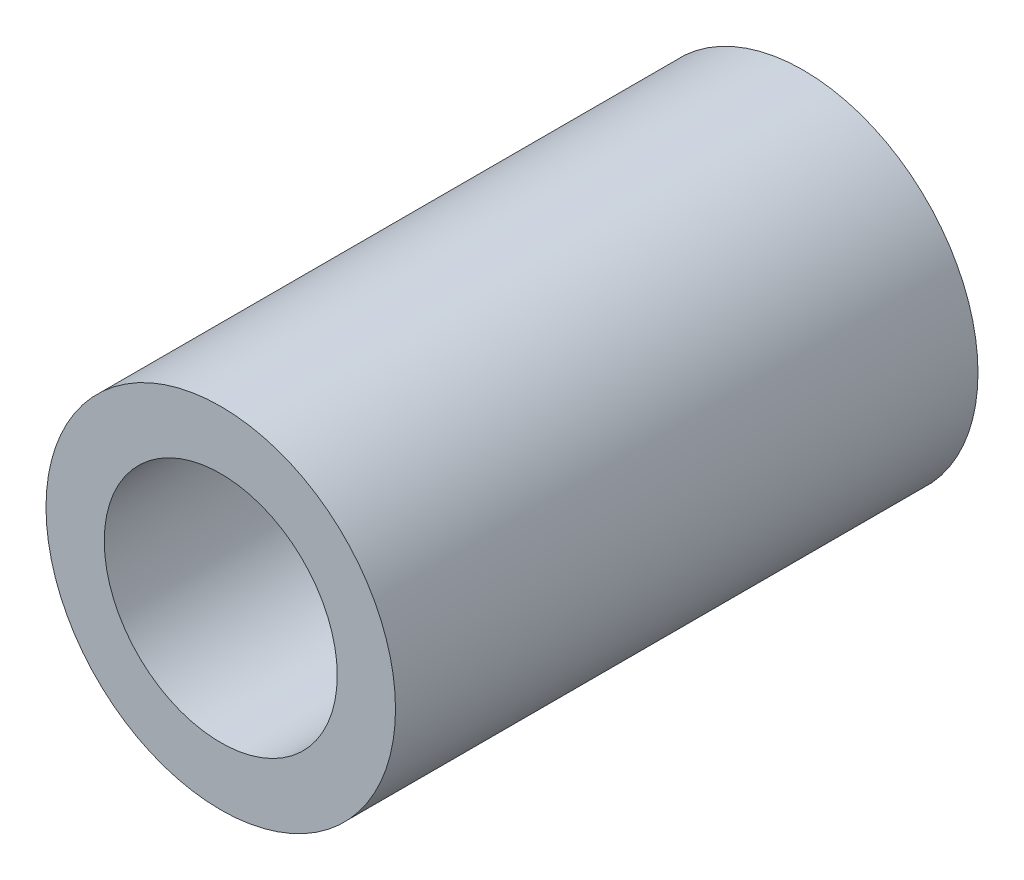
ISO-10303-21;
HEADER;
FILE_DESCRIPTION(('STEP AP214'),'2;1');
FILE_NAME('part.step','',(''),(''),'','','');
FILE_SCHEMA(('AUTOMOTIVE_DESIGN { 1 0 10303 214 1 1 1 1 }'));
ENDSEC;
DATA;
#1=APPLICATION_CONTEXT('core data for automotive mechanical design processes');
#2=APPLICATION_PROTOCOL_DEFINITION('international standard','automotive_design',2000,#1);
#3=PRODUCT_CONTEXT('',#1,'mechanical');
#4=PRODUCT('Part','Part','',(#3));
#5=PRODUCT_RELATED_PRODUCT_CATEGORY('part','',(#4));
#6=PRODUCT_DEFINITION_FORMATION('','',#4);
#7=PRODUCT_DEFINITION_CONTEXT('part definition',#1,'design');
#8=PRODUCT_DEFINITION('design','',#6,#7);
#9=PRODUCT_DEFINITION_SHAPE('','',#8);
#10=(LENGTH_UNIT() NAMED_UNIT(*) SI_UNIT(.MILLI.,.METRE.));
#11=(NAMED_UNIT(*) PLANE_ANGLE_UNIT() SI_UNIT($,.RADIAN.));
#12=(NAMED_UNIT(*) SI_UNIT($,.STERADIAN.) SOLID_ANGLE_UNIT());
#13=UNCERTAINTY_MEASURE_WITH_UNIT(LENGTH_MEASURE(1.E-05),#10,'distance_accuracy_value','');
#14=(GEOMETRIC_REPRESENTATION_CONTEXT(3) GLOBAL_UNCERTAINTY_ASSIGNED_CONTEXT((#13)) GLOBAL_UNIT_ASSIGNED_CONTEXT((#10,
#11,#12)) REPRESENTATION_CONTEXT('',''));
#15=CARTESIAN_POINT('',(0.,0.,0.));
#16=DIRECTION('',(0.,0.,1.));
#17=DIRECTION('',(1.,0.,0.));
#18=AXIS2_PLACEMENT_3D('',#15,#16,#17);
#19=CARTESIAN_POINT('',(0.,0.,10.));
#20=DIRECTION('',(0.,0.,1.));
#21=DIRECTION('',(1.,0.,0.));
#22=AXIS2_PLACEMENT_3D('',#19,#20,#21);
#23=PLANE('',#22);
#24=CARTESIAN_POINT('',(0.,0.,10.));
#25=DIRECTION('',(0.,0.,1.));
#26=DIRECTION('',(1.,0.,0.));
#27=AXIS2_PLACEMENT_3D('',#24,#25,#26);
#28=CIRCLE('',#27,3.);
#29=CARTESIAN_POINT('',(3.,0.,10.));
#30=VERTEX_POINT('',#29);
#31=EDGE_CURVE('E10',#30,#30,#28,.T.);
#32=ORIENTED_EDGE('',*,*,#31,.T.);
#33=EDGE_LOOP('',(#32));
#34=FACE_BOUND('',#33,.T.);
#35=CARTESIAN_POINT('',(0.,0.,10.));
#36=DIRECTION('',(0.,0.,1.));
#37=DIRECTION('',(1.,0.,0.));
#38=AXIS2_PLACEMENT_3D('',#35,#36,#37);
#39=CIRCLE('',#38,2.);
#40=CARTESIAN_POINT('',(2.,0.,10.));
#41=VERTEX_POINT('',#40);
#42=EDGE_CURVE('E44',#41,#41,#39,.T.);
#43=ORIENTED_EDGE('',*,*,#42,.F.);
#44=EDGE_LOOP('',(#43));
#45=FACE_BOUND('',#44,.T.);
#46=ADVANCED_FACE('F33',(#34,#45),#23,.T.);
#47=CARTESIAN_POINT('',(0.,0.,0.));
#48=DIRECTION('',(0.,0.,1.));
#49=DIRECTION('',(1.,0.,0.));
#50=AXIS2_PLACEMENT_3D('',#47,#48,#49);
#51=PLANE('',#50);
#52=CARTESIAN_POINT('',(0.,0.,0.));
#53=DIRECTION('',(0.,0.,1.));
#54=DIRECTION('',(1.,0.,0.));
#55=AXIS2_PLACEMENT_3D('',#52,#53,#54);
#56=CIRCLE('',#55,3.);
#57=CARTESIAN_POINT('',(3.,0.,0.));
#58=VERTEX_POINT('',#57);
#59=EDGE_CURVE('E40',#58,#58,#56,.T.);
#60=ORIENTED_EDGE('',*,*,#59,.F.);
#61=EDGE_LOOP('',(#60));
#62=FACE_BOUND('',#61,.T.);
#63=CARTESIAN_POINT('',(0.,0.,0.));
#64=DIRECTION('',(0.,0.,1.));
#65=DIRECTION('',(1.,0.,0.));
#66=AXIS2_PLACEMENT_3D('',#63,#64,#65);
#67=CIRCLE('',#66,2.);
#68=CARTESIAN_POINT('',(2.,0.,0.));
#69=VERTEX_POINT('',#68);
#70=EDGE_CURVE('E48',#69,#69,#67,.T.);
#71=ORIENTED_EDGE('',*,*,#70,.T.);
#72=EDGE_LOOP('',(#71));
#73=FACE_BOUND('',#72,.T.);
#74=ADVANCED_FACE('F54',(#62,#73),#51,.F.);
#75=CARTESIAN_POINT('',(0.,0.,10.));
#76=DIRECTION('',(0.,0.,-1.));
#77=DIRECTION('',(-1.,0.,0.));
#78=AXIS2_PLACEMENT_3D('',#75,#76,#77);
#79=CYLINDRICAL_SURFACE('',#78,3.);
#80=ORIENTED_EDGE('',*,*,#31,.F.);
#81=EDGE_LOOP('',(#80));
#82=FACE_BOUND('',#81,.T.);
#83=ORIENTED_EDGE('',*,*,#59,.T.);
#84=EDGE_LOOP('',(#83));
#85=FACE_BOUND('',#84,.T.);
#86=ADVANCED_FACE('F35',(#82,#85),#79,.T.);
#87=CARTESIAN_POINT('',(0.,0.,10.));
#88=DIRECTION('',(0.,0.,-1.));
#89=DIRECTION('',(-1.,0.,0.));
#90=AXIS2_PLACEMENT_3D('',#87,#88,#89);
#91=CYLINDRICAL_SURFACE('',#90,2.);
#92=ORIENTED_EDGE('',*,*,#42,.T.);
#93=EDGE_LOOP('',(#92));
#94=FACE_BOUND('',#93,.T.);
#95=ORIENTED_EDGE('',*,*,#70,.F.);
#96=EDGE_LOOP('',(#95));
#97=FACE_BOUND('',#96,.T.);
#98=ADVANCED_FACE('F56',(#94,#97),#91,.F.);
#99=CLOSED_SHELL('',(#46,#74,#86,#98));
#100=MANIFOLD_SOLID_BREP('B2',#99);
#101=ADVANCED_BREP_SHAPE_REPRESENTATION('',(#18,#100),#14);
#102=SHAPE_DEFINITION_REPRESENTATION(#9,#101);
ENDSEC;
END-ISO-10303-21;
